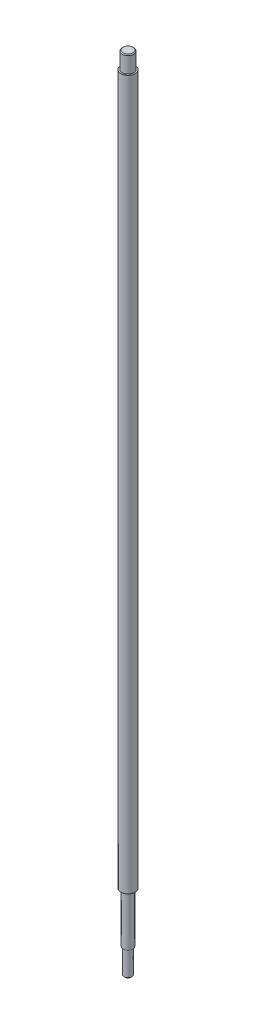
ISO-10303-21;
HEADER;
FILE_DESCRIPTION(('STEP AP214'),'2;1');
FILE_NAME('part.step','',(''),(''),'','','');
FILE_SCHEMA(('AUTOMOTIVE_DESIGN { 1 0 10303 214 1 1 1 1 }'));
ENDSEC;
DATA;
#1=APPLICATION_CONTEXT('core data for automotive mechanical design processes');
#2=APPLICATION_PROTOCOL_DEFINITION('international standard','automotive_design',2000,#1);
#3=PRODUCT_CONTEXT('',#1,'mechanical');
#4=PRODUCT('Part','Part','',(#3));
#5=PRODUCT_RELATED_PRODUCT_CATEGORY('part','',(#4));
#6=PRODUCT_DEFINITION_FORMATION('','',#4);
#7=PRODUCT_DEFINITION_CONTEXT('part definition',#1,'design');
#8=PRODUCT_DEFINITION('design','',#6,#7);
#9=PRODUCT_DEFINITION_SHAPE('','',#8);
#10=(LENGTH_UNIT() NAMED_UNIT(*) SI_UNIT(.MILLI.,.METRE.));
#11=(NAMED_UNIT(*) PLANE_ANGLE_UNIT() SI_UNIT($,.RADIAN.));
#12=(NAMED_UNIT(*) SI_UNIT($,.STERADIAN.) SOLID_ANGLE_UNIT());
#13=UNCERTAINTY_MEASURE_WITH_UNIT(LENGTH_MEASURE(1.E-05),#10,'distance_accuracy_value','');
#14=(GEOMETRIC_REPRESENTATION_CONTEXT(3) GLOBAL_UNCERTAINTY_ASSIGNED_CONTEXT((#13)) GLOBAL_UNIT_ASSIGNED_CONTEXT((#10,
#11,#12)) REPRESENTATION_CONTEXT('',''));
#15=CARTESIAN_POINT('',(0.,0.,0.));
#16=DIRECTION('',(0.,0.,1.));
#17=DIRECTION('',(1.,0.,0.));
#18=AXIS2_PLACEMENT_3D('',#15,#16,#17);
#19=CARTESIAN_POINT('',(0.,-1553.98016375673,0.));
#20=DIRECTION('',(0.,-1.,0.));
#21=DIRECTION('',(0.,0.,-1.));
#22=AXIS2_PLACEMENT_3D('',#19,#20,#21);
#23=PLANE('',#22);
#24=CARTESIAN_POINT('',(0.,-1553.98016375673,0.));
#25=DIRECTION('',(0.,-1.,0.));
#26=DIRECTION('',(0.,0.,-1.));
#27=AXIS2_PLACEMENT_3D('',#24,#25,#26);
#28=CIRCLE('',#27,21.3333333333333);
#29=CARTESIAN_POINT('',(0.,-1553.98016375673,-21.3333333333333));
#30=VERTEX_POINT('',#29);
#31=EDGE_CURVE('E77',#30,#30,#28,.T.);
#32=ORIENTED_EDGE('',*,*,#31,.T.);
#33=EDGE_LOOP('',(#32));
#34=FACE_BOUND('',#33,.T.);
#35=CARTESIAN_POINT('',(0.,-1553.98016375673,0.));
#36=DIRECTION('',(0.,-1.,0.));
#37=DIRECTION('',(0.,0.,-1.));
#38=AXIS2_PLACEMENT_3D('',#35,#36,#37);
#39=CIRCLE('',#38,17.0666666666667);
#40=CARTESIAN_POINT('',(0.,-1553.98016375673,-17.0666666666667));
#41=VERTEX_POINT('',#40);
#42=EDGE_CURVE('E81',#41,#41,#39,.T.);
#43=ORIENTED_EDGE('',*,*,#42,.F.);
#44=EDGE_LOOP('',(#43));
#45=FACE_BOUND('',#44,.T.);
#46=ADVANCED_FACE('F37',(#34,#45),#23,.T.);
#47=CARTESIAN_POINT('',(0.,-1328.98016375673,0.));
#48=DIRECTION('',(0.,1.,0.));
#49=DIRECTION('',(0.,0.,1.));
#50=AXIS2_PLACEMENT_3D('',#47,#48,#49);
#51=PLANE('',#50);
#52=CARTESIAN_POINT('',(0.,-1328.98016375673,0.));
#53=DIRECTION('',(0.,1.,0.));
#54=DIRECTION('',(0.,0.,1.));
#55=AXIS2_PLACEMENT_3D('',#52,#53,#54);
#56=CIRCLE('',#55,32.);
#57=CARTESIAN_POINT('',(0.,-1328.98016375673,32.));
#58=VERTEX_POINT('',#57);
#59=EDGE_CURVE('E66',#58,#58,#56,.T.);
#60=ORIENTED_EDGE('',*,*,#59,.F.);
#61=EDGE_LOOP('',(#60));
#62=FACE_BOUND('',#61,.T.);
#63=CARTESIAN_POINT('',(0.,-1328.98016375673,0.));
#64=DIRECTION('',(0.,1.,0.));
#65=DIRECTION('',(0.,0.,1.));
#66=AXIS2_PLACEMENT_3D('',#63,#64,#65);
#67=CIRCLE('',#66,21.3333333333333);
#68=CARTESIAN_POINT('',(0.,-1328.98016375673,21.3333333333333));
#69=VERTEX_POINT('',#68);
#70=EDGE_CURVE('E50',#69,#69,#67,.F.);
#71=ORIENTED_EDGE('',*,*,#70,.F.);
#72=EDGE_LOOP('',(#71));
#73=FACE_BOUND('',#72,.T.);
#74=ADVANCED_FACE('F89',(#62,#73),#51,.F.);
#75=CARTESIAN_POINT('',(0.,1828.51983624327,0.));
#76=DIRECTION('',(0.,1.,0.));
#77=DIRECTION('',(0.,0.,1.));
#78=AXIS2_PLACEMENT_3D('',#75,#76,#77);
#79=PLANE('',#78);
#80=CARTESIAN_POINT('',(0.,1828.51983624327,0.));
#81=DIRECTION('',(0.,1.,0.));
#82=DIRECTION('',(0.,0.,1.));
#83=AXIS2_PLACEMENT_3D('',#80,#81,#82);
#84=CIRCLE('',#83,32.);
#85=CARTESIAN_POINT('',(0.,1828.51983624327,32.));
#86=VERTEX_POINT('',#85);
#87=EDGE_CURVE('E65',#86,#86,#84,.T.);
#88=ORIENTED_EDGE('',*,*,#87,.T.);
#89=EDGE_LOOP('',(#88));
#90=FACE_BOUND('',#89,.T.);
#91=CARTESIAN_POINT('',(0.,1828.51983624327,0.));
#92=DIRECTION('',(0.,1.,0.));
#93=DIRECTION('',(0.,0.,1.));
#94=AXIS2_PLACEMENT_3D('',#91,#92,#93);
#95=CIRCLE('',#94,25.6);
#96=CARTESIAN_POINT('',(0.,1828.51983624327,25.6));
#97=VERTEX_POINT('',#96);
#98=EDGE_CURVE('E70',#97,#97,#95,.T.);
#99=ORIENTED_EDGE('',*,*,#98,.F.);
#100=EDGE_LOOP('',(#99));
#101=FACE_BOUND('',#100,.T.);
#102=ADVANCED_FACE('F95',(#90,#101),#79,.T.);
#103=CARTESIAN_POINT('',(0.,1828.51983624327,0.));
#104=DIRECTION('',(0.,-1.,0.));
#105=DIRECTION('',(0.,0.,-1.));
#106=AXIS2_PLACEMENT_3D('',#103,#104,#105);
#107=CYLINDRICAL_SURFACE('',#106,32.);
#108=ORIENTED_EDGE('',*,*,#87,.F.);
#109=EDGE_LOOP('',(#108));
#110=FACE_BOUND('',#109,.T.);
#111=ORIENTED_EDGE('',*,*,#59,.T.);
#112=EDGE_LOOP('',(#111));
#113=FACE_BOUND('',#112,.T.);
#114=ADVANCED_FACE('F113',(#110,#113),#107,.T.);
#115=CARTESIAN_POINT('',(0.,1903.51983624327,0.));
#116=DIRECTION('',(0.,-1.,0.));
#117=DIRECTION('',(0.,0.,-1.));
#118=AXIS2_PLACEMENT_3D('',#115,#116,#117);
#119=CYLINDRICAL_SURFACE('',#118,25.6);
#120=CARTESIAN_POINT('',(0.,1899.76983624327,0.));
#121=DIRECTION('',(0.,1.,0.));
#122=DIRECTION('',(0.,0.,1.));
#123=AXIS2_PLACEMENT_3D('',#120,#121,#122);
#124=CIRCLE('',#123,25.6);
#125=CARTESIAN_POINT('',(0.,1899.76983624327,25.6));
#126=VERTEX_POINT('',#125);
#127=EDGE_CURVE('E55',#126,#126,#124,.F.);
#128=ORIENTED_EDGE('',*,*,#127,.T.);
#129=EDGE_LOOP('',(#128));
#130=FACE_BOUND('',#129,.T.);
#131=ORIENTED_EDGE('',*,*,#98,.T.);
#132=EDGE_LOOP('',(#131));
#133=FACE_BOUND('',#132,.T.);
#134=ADVANCED_FACE('F109',(#130,#133),#119,.T.);
#135=CARTESIAN_POINT('',(0.,1903.51983624327,0.));
#136=DIRECTION('',(0.,1.,0.));
#137=DIRECTION('',(0.,0.,1.));
#138=AXIS2_PLACEMENT_3D('',#135,#136,#137);
#139=PLANE('',#138);
#140=CARTESIAN_POINT('',(0.,1903.51983624327,0.));
#141=DIRECTION('',(0.,1.,0.));
#142=DIRECTION('',(0.,0.,1.));
#143=AXIS2_PLACEMENT_3D('',#140,#141,#142);
#144=CIRCLE('',#143,21.8499999999999);
#145=CARTESIAN_POINT('',(0.,1903.51983624327,21.8499999999999));
#146=VERTEX_POINT('',#145);
#147=EDGE_CURVE('E61',#146,#146,#144,.T.);
#148=ORIENTED_EDGE('',*,*,#147,.T.);
#149=EDGE_LOOP('',(#148));
#150=FACE_BOUND('',#149,.T.);
#151=ADVANCED_FACE('F106',(#150),#139,.T.);
#152=CARTESIAN_POINT('',(0.,1903.51983624327,0.));
#153=DIRECTION('',(0.,-1.,0.));
#154=DIRECTION('',(0.,0.,-1.));
#155=AXIS2_PLACEMENT_3D('',#152,#153,#154);
#156=CONICAL_SURFACE('',#155,21.8499999999999,0.785398163397458);
#157=ORIENTED_EDGE('',*,*,#127,.F.);
#158=EDGE_LOOP('',(#157));
#159=FACE_BOUND('',#158,.T.);
#160=ORIENTED_EDGE('',*,*,#147,.F.);
#161=EDGE_LOOP('',(#160));
#162=FACE_BOUND('',#161,.T.);
#163=ADVANCED_FACE('F104',(#159,#162),#156,.T.);
#164=CARTESIAN_POINT('',(0.,-1553.98016375673,0.));
#165=DIRECTION('',(0.,1.,0.));
#166=DIRECTION('',(0.,0.,1.));
#167=AXIS2_PLACEMENT_3D('',#164,#165,#166);
#168=CYLINDRICAL_SURFACE('',#167,21.3333333333333);
#169=ORIENTED_EDGE('',*,*,#31,.F.);
#170=EDGE_LOOP('',(#169));
#171=FACE_BOUND('',#170,.T.);
#172=ORIENTED_EDGE('',*,*,#70,.T.);
#173=EDGE_LOOP('',(#172));
#174=FACE_BOUND('',#173,.T.);
#175=ADVANCED_FACE('F101',(#171,#174),#168,.T.);
#176=CARTESIAN_POINT('',(0.,-1666.48016375673,0.));
#177=DIRECTION('',(0.,1.,0.));
#178=DIRECTION('',(0.,0.,1.));
#179=AXIS2_PLACEMENT_3D('',#176,#177,#178);
#180=CYLINDRICAL_SURFACE('',#179,17.0666666666667);
#181=CARTESIAN_POINT('',(0.,-1662.73016375673,0.));
#182=DIRECTION('',(0.,-1.,0.));
#183=DIRECTION('',(0.,0.,-1.));
#184=AXIS2_PLACEMENT_3D('',#181,#182,#183);
#185=CIRCLE('',#184,17.0666666666667);
#186=CARTESIAN_POINT('',(0.,-1662.73016375673,-17.0666666666667));
#187=VERTEX_POINT('',#186);
#188=EDGE_CURVE('E10',#187,#187,#185,.F.);
#189=ORIENTED_EDGE('',*,*,#188,.T.);
#190=EDGE_LOOP('',(#189));
#191=FACE_BOUND('',#190,.T.);
#192=ORIENTED_EDGE('',*,*,#42,.T.);
#193=EDGE_LOOP('',(#192));
#194=FACE_BOUND('',#193,.T.);
#195=ADVANCED_FACE('F86',(#191,#194),#180,.T.);
#196=CARTESIAN_POINT('',(0.,-1666.48016375673,0.));
#197=DIRECTION('',(0.,-1.,0.));
#198=DIRECTION('',(0.,0.,-1.));
#199=AXIS2_PLACEMENT_3D('',#196,#197,#198);
#200=PLANE('',#199);
#201=CARTESIAN_POINT('',(0.,-1666.48016375673,0.));
#202=DIRECTION('',(0.,-1.,0.));
#203=DIRECTION('',(0.,0.,-1.));
#204=AXIS2_PLACEMENT_3D('',#201,#202,#203);
#205=CIRCLE('',#204,13.3166666666665);
#206=CARTESIAN_POINT('',(0.,-1666.48016375673,-13.3166666666665));
#207=VERTEX_POINT('',#206);
#208=EDGE_CURVE('E45',#207,#207,#205,.T.);
#209=ORIENTED_EDGE('',*,*,#208,.T.);
#210=EDGE_LOOP('',(#209));
#211=FACE_BOUND('',#210,.T.);
#212=ADVANCED_FACE('F142',(#211),#200,.T.);
#213=CARTESIAN_POINT('',(0.,-1666.48016375673,0.));
#214=DIRECTION('',(0.,1.,0.));
#215=DIRECTION('',(0.,0.,1.));
#216=AXIS2_PLACEMENT_3D('',#213,#214,#215);
#217=CONICAL_SURFACE('',#216,13.3166666666665,0.785398163397438);
#218=ORIENTED_EDGE('',*,*,#188,.F.);
#219=EDGE_LOOP('',(#218));
#220=FACE_BOUND('',#219,.T.);
#221=ORIENTED_EDGE('',*,*,#208,.F.);
#222=EDGE_LOOP('',(#221));
#223=FACE_BOUND('',#222,.T.);
#224=ADVANCED_FACE('F39',(#220,#223),#217,.T.);
#225=CLOSED_SHELL('',(#46,#74,#102,#114,#134,#151,#163,#175,#195,#212,#224));
#226=MANIFOLD_SOLID_BREP('B2',#225);
#227=ADVANCED_BREP_SHAPE_REPRESENTATION('',(#18,#226),#14);
#228=SHAPE_DEFINITION_REPRESENTATION(#9,#227);
ENDSEC;
END-ISO-10303-21;
